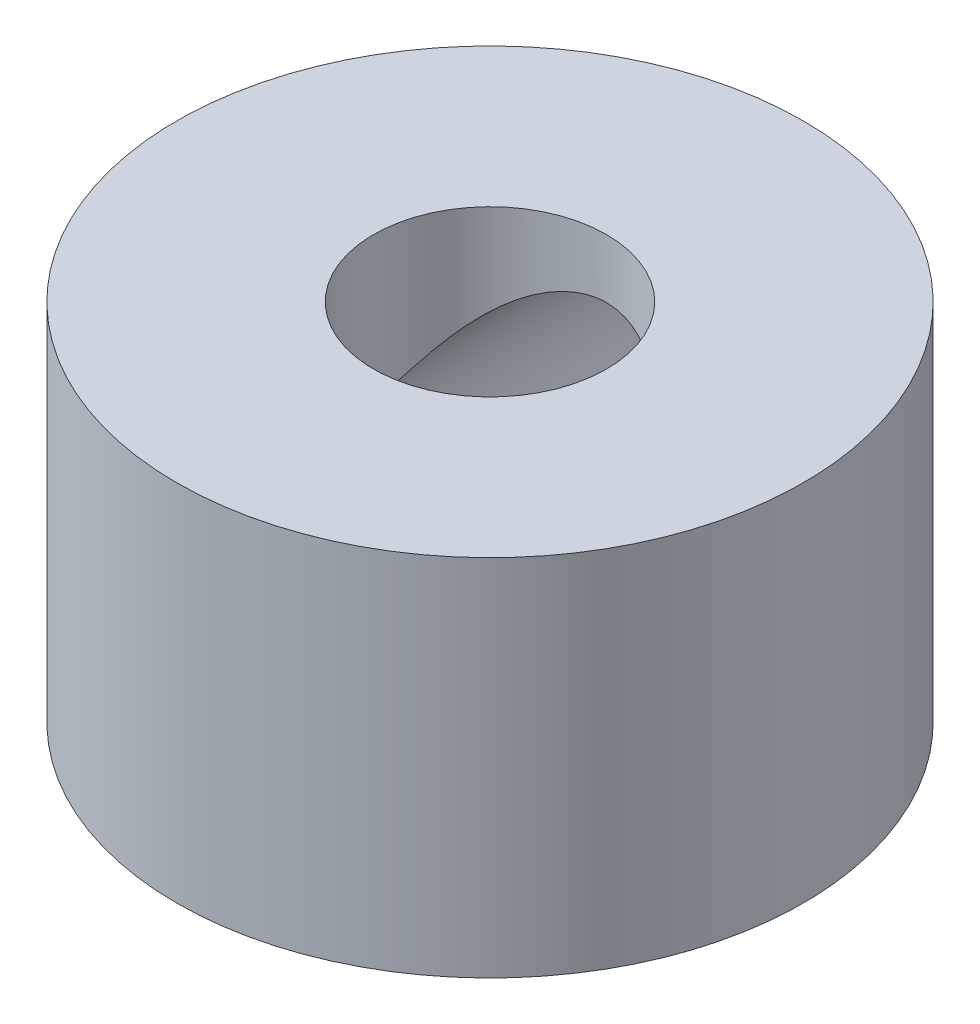
ISO-10303-21;
HEADER;
FILE_DESCRIPTION(('STEP AP214'),'2;1');
FILE_NAME('part.step','',(''),(''),'','','');
FILE_SCHEMA(('AUTOMOTIVE_DESIGN { 1 0 10303 214 1 1 1 1 }'));
ENDSEC;
DATA;
#1=APPLICATION_CONTEXT('core data for automotive mechanical design processes');
#2=APPLICATION_PROTOCOL_DEFINITION('international standard','automotive_design',2000,#1);
#3=PRODUCT_CONTEXT('',#1,'mechanical');
#4=PRODUCT('Part','Part','',(#3));
#5=PRODUCT_RELATED_PRODUCT_CATEGORY('part','',(#4));
#6=PRODUCT_DEFINITION_FORMATION('','',#4);
#7=PRODUCT_DEFINITION_CONTEXT('part definition',#1,'design');
#8=PRODUCT_DEFINITION('design','',#6,#7);
#9=PRODUCT_DEFINITION_SHAPE('','',#8);
#10=(LENGTH_UNIT() NAMED_UNIT(*) SI_UNIT(.MILLI.,.METRE.));
#11=(NAMED_UNIT(*) PLANE_ANGLE_UNIT() SI_UNIT($,.RADIAN.));
#12=(NAMED_UNIT(*) SI_UNIT($,.STERADIAN.) SOLID_ANGLE_UNIT());
#13=UNCERTAINTY_MEASURE_WITH_UNIT(LENGTH_MEASURE(1.E-05),#10,'distance_accuracy_value','');
#14=(GEOMETRIC_REPRESENTATION_CONTEXT(3) GLOBAL_UNCERTAINTY_ASSIGNED_CONTEXT((#13)) GLOBAL_UNIT_ASSIGNED_CONTEXT((#10,
#11,#12)) REPRESENTATION_CONTEXT('',''));
#15=CARTESIAN_POINT('',(0.,0.,0.));
#16=DIRECTION('',(0.,0.,1.));
#17=DIRECTION('',(1.,0.,0.));
#18=AXIS2_PLACEMENT_3D('',#15,#16,#17);
#19=CARTESIAN_POINT('',(0.,3.19405,0.));
#20=DIRECTION('',(0.,0.,1.));
#21=DIRECTION('',(1.,0.,0.));
#22=AXIS2_PLACEMENT_3D('',#19,#20,#21);
#23=PLANE('',#22);
#24=DIRECTION('',(0.,-1.,0.));
#25=VECTOR('',#24,1.);
#26=CARTESIAN_POINT('',(-2.0447,6.3881,0.));
#27=LINE('',#26,#25);
#28=CARTESIAN_POINT('',(-2.0447,3.88721874568895,0.));
#29=VERTEX_POINT('',#28);
#30=CARTESIAN_POINT('',(-2.0447,2.50088125431104,0.));
#31=VERTEX_POINT('',#30);
#32=EDGE_CURVE('E60',#29,#31,#27,.T.);
#33=ORIENTED_EDGE('',*,*,#32,.T.);
#34=CARTESIAN_POINT('',(0.,3.19405,0.));
#35=DIRECTION('',(0.,0.,1.));
#36=DIRECTION('',(1.,0.,0.));
#37=AXIS2_PLACEMENT_3D('',#34,#35,#36);
#38=CIRCLE('',#37,2.159);
#39=EDGE_CURVE('E43',#31,#29,#38,.F.);
#40=ORIENTED_EDGE('',*,*,#39,.T.);
#41=EDGE_LOOP('',(#33,#40));
#42=FACE_BOUND('',#41,.T.);
#43=ADVANCED_FACE('F17',(#42),#23,.F.);
#44=CARTESIAN_POINT('',(0.,6.3881,0.));
#45=DIRECTION('',(0.,-1.,0.));
#46=DIRECTION('',(0.,0.,-1.));
#47=AXIS2_PLACEMENT_3D('',#44,#45,#46);
#48=CYLINDRICAL_SURFACE('',#47,2.0447);
#49=DIRECTION('',(0.,1.,0.));
#50=VECTOR('',#49,1.);
#51=CARTESIAN_POINT('',(2.0447,3.19405,0.));
#52=LINE('',#51,#50);
#53=CARTESIAN_POINT('',(2.0447,3.88721874568895,0.));
#54=VERTEX_POINT('',#53);
#55=CARTESIAN_POINT('',(2.0447,2.50088125431104,0.));
#56=VERTEX_POINT('',#55);
#57=EDGE_CURVE('E55',#54,#56,#52,.F.);
#58=ORIENTED_EDGE('',*,*,#57,.T.);
#59=CARTESIAN_POINT('',(2.0447,2.50088125431104,0.));
#60=CARTESIAN_POINT('',(2.04470617199786,2.50091754640206,-0.0260635474018102));
#61=CARTESIAN_POINT('',(2.04420172874444,2.49941111831766,-0.0520883043571842));
#62=CARTESIAN_POINT('',(2.04223034606037,2.49362729040617,-0.103685006571274));
#63=CARTESIAN_POINT('',(2.04076747283227,2.48936159790736,-0.129258398146651));
#64=CARTESIAN_POINT('',(2.03510834088345,2.47312064172248,-0.203932029545053));
#65=CARTESIAN_POINT('',(2.02963586743582,2.45767309404115,-0.252180409460516));
#66=CARTESIAN_POINT('',(2.01722671913072,2.42442426490881,-0.336191631267497));
#67=CARTESIAN_POINT('',(2.01080886185513,2.40772817498889,-0.372508301241373));
#68=CARTESIAN_POINT('',(1.99635103823395,2.37170979115091,-0.443495307036483));
#69=CARTESIAN_POINT('',(1.98831003649392,2.35238582350538,-0.478164574461371));
#70=CARTESIAN_POINT('',(1.96171976878988,2.29132954390556,-0.580975144021699));
#71=CARTESIAN_POINT('',(1.94085831666927,2.24696173907065,-0.646933563168779));
#72=CARTESIAN_POINT('',(1.8927615645623,2.15405828562069,-0.776637434662795));
#73=CARTESIAN_POINT('',(1.86534900453808,2.10543614991278,-0.840251247787284));
#74=CARTESIAN_POINT('',(1.80453249240513,2.00734105909746,-0.963955545848678));
#75=CARTESIAN_POINT('',(1.77112366599197,1.95786744163219,-1.0240431112077));
#76=CARTESIAN_POINT('',(1.69837966313964,1.85969357042641,-1.140613706982));
#77=CARTESIAN_POINT('',(1.65907260612555,1.8109907983822,-1.19711212082169));
#78=CARTESIAN_POINT('',(1.57426609958005,1.71517894152762,-1.30662771770483));
#79=CARTESIAN_POINT('',(1.52877049940659,1.66806888858954,-1.35964703464135));
#80=CARTESIAN_POINT('',(1.40944344348407,1.55571001557766,-1.48483923502472));
#81=CARTESIAN_POINT('',(1.33206281265279,1.49181753722746,-1.55491953732738));
#82=CARTESIAN_POINT('',(1.16339507629861,1.37239058452521,-1.68481538216945));
#83=CARTESIAN_POINT('',(1.07212203836397,1.31684776705557,-1.74464117967459));
#84=CARTESIAN_POINT('',(0.896665121293488,1.22813781281328,-1.83971565793369));
#85=CARTESIAN_POINT('',(0.814998928352635,1.19272066947559,-1.87748752408964));
#86=CARTESIAN_POINT('',(0.644284870586461,1.13143852353685,-1.94268043620764));
#87=CARTESIAN_POINT('',(0.555247603064895,1.1055600895702,-1.97011603777885));
#88=CARTESIAN_POINT('',(0.388739139234518,1.06895357362168,-2.00887631379975));
#89=CARTESIAN_POINT('',(0.312162040957052,1.0563119009579,-2.02223874761811));
#90=CARTESIAN_POINT('',(0.157064375229523,1.03935865047825,-2.04015204240416));
#91=CARTESIAN_POINT('',(0.0785440065269985,1.0350462243273,-2.04470380074066));
#92=CARTESIAN_POINT('',(-0.0931045820543901,1.03505447561111,-2.0446954946738));
#93=CARTESIAN_POINT('',(-0.18624237828699,1.04112376893482,-2.0382898439631));
#94=CARTESIAN_POINT('',(-0.369336773949531,1.06486742271077,-2.01319435377752));
#95=CARTESIAN_POINT('',(-0.459290574564305,1.08255173856206,-1.99449397630569));
#96=CARTESIAN_POINT('',(-0.632877106470563,1.12795397997397,-1.94636409568439));
#97=CARTESIAN_POINT('',(-0.716546565044372,1.15560705151574,-1.91700393357411));
#98=CARTESIAN_POINT('',(-0.87670196273367,1.21917971146197,-1.84926099303423));
#99=CARTESIAN_POINT('',(-0.953185944029861,1.2551015437013,-1.81087576547606));
#100=CARTESIAN_POINT('',(-1.12784451221266,1.34940754729615,-1.70958867613578));
#101=CARTESIAN_POINT('',(-1.2221879693436,1.41098519265358,-1.64306531382934));
#102=CARTESIAN_POINT('',(-1.39526197071782,1.54286379264467,-1.49893221984492));
#103=CARTESIAN_POINT('',(-1.47394374123102,1.61319092320414,-1.42128911104363));
#104=CARTESIAN_POINT('',(-1.59112154059385,1.73323674310927,-1.28611202903244));
#105=CARTESIAN_POINT('',(-1.63403857707954,1.7815427823712,-1.23106373740685));
#106=CARTESIAN_POINT('',(-1.71369200019671,1.87931979148108,-1.11752995906973));
#107=CARTESIAN_POINT('',(-1.75042387105772,1.9287915826595,-1.05904200274368));
#108=CARTESIAN_POINT('',(-1.81776829683903,2.027615866108,-0.938756038911843));
#109=CARTESIAN_POINT('',(-1.84839082236244,2.07696842072586,-0.876963636885601));
#110=CARTESIAN_POINT('',(-1.90362976515796,2.17396860821924,-0.749546076866845));
#111=CARTESIAN_POINT('',(-1.92825355495983,2.22161827185108,-0.68392574771254));
#112=CARTESIAN_POINT('',(-1.96516292620499,2.29922916458566,-0.567042314984152));
#113=CARTESIAN_POINT('',(-1.97896336352726,2.33035313712099,-0.517037125226159));
#114=CARTESIAN_POINT('',(-2.0031313132669,2.38800256634513,-0.413615524622767));
#115=CARTESIAN_POINT('',(-2.01350429291604,2.41453531409985,-0.360204710158033));
#116=CARTESIAN_POINT('',(-2.02790439555594,2.45297925887348,-0.264656564482849));
#117=CARTESIAN_POINT('',(-2.03289366509492,2.46690475650676,-0.223502424938951));
#118=CARTESIAN_POINT('',(-2.04037561826575,2.48815607917188,-0.139361068900957));
#119=CARTESIAN_POINT('',(-2.04287909826282,2.49551043015333,-0.096382632392261));
#120=CARTESIAN_POINT('',(-2.04447208862978,2.50021345471073,-0.0354357391955627));
#121=CARTESIAN_POINT('',(-2.04470521262352,2.50090783247626,-0.017719357980037));
#122=CARTESIAN_POINT('',(-2.04470000000001,2.50088125430428,5.16655095470708E-13));
#123=B_SPLINE_CURVE_WITH_KNOTS('',3,(#59,#60,#61,#62,#63,#64,#65,#66,#67,#68,#69,#70,#71,#72,
#73,#74,#75,#76,#77,#78,#79,#80,#81,#82,#83,#84,#85,#86,#87,#88,#89,#90,#91,#92,#93,#94,#95,#96,
#97,#98,#99,#100,#101,#102,#103,#104,#105,#106,#107,#108,#109,#110,#111,#112,#113,#114,#115,
#116,#117,#118,#119,#120,#121,#122),.UNSPECIFIED.,.F.,.F.,(4,2,2,2,2,2,2,2,2,2,2,2,2,2,2,2,2,2,
2,2,2,2,2,2,2,2,2,2,2,2,2,4),(0.,0.0780775969975376,0.155826071151518,0.307813366091773,
0.429109563801369,0.550483381560565,0.796482314264449,1.05009359182283,1.30391196891928,
1.5565566224356,1.80904484008976,2.17493384282535,2.54045477780561,2.82943582831685,
3.11800839868693,3.35337747732871,3.58872258232785,3.86769622536399,4.1469092932171,
4.42433772242534,4.70184152435199,5.09221895881834,5.48379371669307,5.73817335827079,
5.9927379238711,6.24688357264647,6.50071527902254,6.68198836949557,6.86297089445767,
6.99374440007659,7.12394740830218,7.17709243806165),.UNSPECIFIED.);
#124=EDGE_CURVE('E47',#56,#31,#123,.T.);
#125=ORIENTED_EDGE('',*,*,#124,.T.);
#126=ORIENTED_EDGE('',*,*,#32,.F.);
#127=CARTESIAN_POINT('',(-2.0447,3.88721874568895,0.));
#128=CARTESIAN_POINT('',(-2.04470617199786,3.88718245359794,-0.02606354740181));
#129=CARTESIAN_POINT('',(-2.04420172874444,3.88868888168234,-0.052088304357184));
#130=CARTESIAN_POINT('',(-2.04223034606037,3.89447270959383,-0.103685006571274));
#131=CARTESIAN_POINT('',(-2.04076747283227,3.89873840209264,-0.129258398146651));
#132=CARTESIAN_POINT('',(-2.03510834088345,3.91497935827752,-0.203932029545052));
#133=CARTESIAN_POINT('',(-2.02963586743582,3.93042690595885,-0.252180409460516));
#134=CARTESIAN_POINT('',(-2.01722671913072,3.96367573509119,-0.336191631267496));
#135=CARTESIAN_POINT('',(-2.01080886185513,3.98037182501111,-0.372508301241372));
#136=CARTESIAN_POINT('',(-1.99635103823395,4.01639020884909,-0.443495307036483));
#137=CARTESIAN_POINT('',(-1.98831003649393,4.03571417649461,-0.47816457446137));
#138=CARTESIAN_POINT('',(-1.96171976878988,4.09677045609444,-0.580975144021698));
#139=CARTESIAN_POINT('',(-1.94085831666927,4.14113826092934,-0.646933563168777));
#140=CARTESIAN_POINT('',(-1.8927615645623,4.2340417143793,-0.776637434662793));
#141=CARTESIAN_POINT('',(-1.86534900453808,4.28266385008722,-0.840251247787283));
#142=CARTESIAN_POINT('',(-1.80453249240513,4.38075894090253,-0.963955545848677));
#143=CARTESIAN_POINT('',(-1.77112366599197,4.43023255836781,-1.0240431112077));
#144=CARTESIAN_POINT('',(-1.69837966313964,4.52840642957358,-1.140613706982));
#145=CARTESIAN_POINT('',(-1.65907260612555,4.5771092016178,-1.19711212082169));
#146=CARTESIAN_POINT('',(-1.57426609958006,4.67292105847238,-1.30662771770482));
#147=CARTESIAN_POINT('',(-1.52877049940659,4.72003111141045,-1.35964703464135));
#148=CARTESIAN_POINT('',(-1.40944344348408,4.83238998442234,-1.48483923502471));
#149=CARTESIAN_POINT('',(-1.33206281265279,4.89628246277254,-1.55491953732738));
#150=CARTESIAN_POINT('',(-1.16339507629861,5.01570941547479,-1.68481538216945));
#151=CARTESIAN_POINT('',(-1.07212203836397,5.07125223294443,-1.74464117967459));
#152=CARTESIAN_POINT('',(-0.896665121293491,5.15996218718671,-1.83971565793368));
#153=CARTESIAN_POINT('',(-0.814998928352638,5.1953793305244,-1.87748752408964));
#154=CARTESIAN_POINT('',(-0.644284870586463,5.25666147646315,-1.94268043620763));
#155=CARTESIAN_POINT('',(-0.555247603064898,5.28253991042979,-1.97011603777885));
#156=CARTESIAN_POINT('',(-0.38873913923452,5.31914642637832,-2.00887631379975));
#157=CARTESIAN_POINT('',(-0.312162040957053,5.3317880990421,-2.02223874761811));
#158=CARTESIAN_POINT('',(-0.157064375229524,5.34874134952175,-2.04015204240416));
#159=CARTESIAN_POINT('',(-0.0785440065269993,5.3530537756727,-2.04470380074066));
#160=CARTESIAN_POINT('',(0.0931045820543896,5.35304552438889,-2.0446954946738));
#161=CARTESIAN_POINT('',(0.186242378286989,5.34697623106518,-2.0382898439631));
#162=CARTESIAN_POINT('',(0.36933677394953,5.32323257728923,-2.01319435377752));
#163=CARTESIAN_POINT('',(0.459290574564304,5.30554826143793,-1.99449397630569));
#164=CARTESIAN_POINT('',(0.632877106470562,5.26014602002603,-1.94636409568439));
#165=CARTESIAN_POINT('',(0.71654656504437,5.23249294848426,-1.91700393357411));
#166=CARTESIAN_POINT('',(0.876701962733669,5.16892028853803,-1.84926099303423));
#167=CARTESIAN_POINT('',(0.95318594402986,5.1329984562987,-1.81087576547606));
#168=CARTESIAN_POINT('',(1.12784451221266,5.03869245270385,-1.70958867613578));
#169=CARTESIAN_POINT('',(1.2221879693436,4.97711480734642,-1.64306531382934));
#170=CARTESIAN_POINT('',(1.39526197071782,4.84523620735533,-1.49893221984492));
#171=CARTESIAN_POINT('',(1.47394374123102,4.77490907679586,-1.42128911104363));
#172=CARTESIAN_POINT('',(1.59112154059385,4.65486325689073,-1.28611202903245));
#173=CARTESIAN_POINT('',(1.63403857707953,4.6065572176288,-1.23106373740685));
#174=CARTESIAN_POINT('',(1.71369200019671,4.50878020851891,-1.11752995906973));
#175=CARTESIAN_POINT('',(1.75042387105772,4.4593084173405,-1.05904200274368));
#176=CARTESIAN_POINT('',(1.81776829683903,4.360484133892,-0.938756038911845));
#177=CARTESIAN_POINT('',(1.84839082236244,4.31113157927414,-0.876963636885604));
#178=CARTESIAN_POINT('',(1.90362976515795,4.21413139178076,-0.749546076866848));
#179=CARTESIAN_POINT('',(1.92825355495983,4.16648172814892,-0.683925747712542));
#180=CARTESIAN_POINT('',(1.96516292620499,4.08887083541434,-0.567042314984153));
#181=CARTESIAN_POINT('',(1.97896336352726,4.05774686287901,-0.517037125226159));
#182=CARTESIAN_POINT('',(2.0031313132669,4.00009743365487,-0.413615524622767));
#183=CARTESIAN_POINT('',(2.01350429291604,3.97356468590015,-0.360204710158034));
#184=CARTESIAN_POINT('',(2.02790439555594,3.93512074112652,-0.26465656448285));
#185=CARTESIAN_POINT('',(2.03289366509492,3.92119524349324,-0.223502424938951));
#186=CARTESIAN_POINT('',(2.04037561826575,3.89994392082812,-0.139361068900957));
#187=CARTESIAN_POINT('',(2.04287909826282,3.89258956984667,-0.0963826323922614));
#188=CARTESIAN_POINT('',(2.04447208862978,3.88788654528926,-0.0354357391955629));
#189=CARTESIAN_POINT('',(2.04470521262352,3.88719216752374,-0.0177193579800372));
#190=CARTESIAN_POINT('',(2.04470000000001,3.88721874569572,5.16457341918653E-13));
#191=B_SPLINE_CURVE_WITH_KNOTS('',3,(#127,#128,#129,#130,#131,#132,#133,#134,#135,#136,#137,
#138,#139,#140,#141,#142,#143,#144,#145,#146,#147,#148,#149,#150,#151,#152,#153,#154,#155,#156,
#157,#158,#159,#160,#161,#162,#163,#164,#165,#166,#167,#168,#169,#170,#171,#172,#173,#174,#175,
#176,#177,#178,#179,#180,#181,#182,#183,#184,#185,#186,#187,#188,#189,#190),.UNSPECIFIED.,.F.,
.F.,(4,2,2,2,2,2,2,2,2,2,2,2,2,2,2,2,2,2,2,2,2,2,2,2,2,2,2,2,2,2,2,4),(0.,0.0780775969975376,
0.155826071151518,0.307813366091773,0.429109563801368,0.550483381560563,0.796482314264448,
1.05009359182283,1.30391196891928,1.5565566224356,1.80904484008976,2.17493384282535,
2.5404547778056,2.82943582831685,3.11800839868693,3.35337747732871,3.58872258232785,
3.86769622536399,4.1469092932171,4.42433772242534,4.70184152435199,5.09221895881834,
5.48379371669306,5.73817335827079,5.9927379238711,6.24688357264647,6.50071527902254,
6.68198836949557,6.86297089445767,6.99374440007659,7.12394740830218,7.17709243806165),.UNSPECIFIED.);
#192=EDGE_CURVE('E35',#29,#54,#191,.T.);
#193=ORIENTED_EDGE('',*,*,#192,.T.);
#194=EDGE_LOOP('',(#58,#125,#126,#193));
#195=FACE_BOUND('',#194,.T.);
#196=CARTESIAN_POINT('',(0.,6.3881,0.));
#197=DIRECTION('',(0.,-1.,0.));
#198=DIRECTION('',(0.,0.,-1.));
#199=AXIS2_PLACEMENT_3D('',#196,#197,#198);
#200=CIRCLE('',#199,2.0447);
#201=CARTESIAN_POINT('',(0.,6.3881,-2.0447));
#202=VERTEX_POINT('',#201);
#203=EDGE_CURVE('E20',#202,#202,#200,.T.);
#204=ORIENTED_EDGE('',*,*,#203,.F.);
#205=EDGE_LOOP('',(#204));
#206=FACE_BOUND('',#205,.T.);
#207=CARTESIAN_POINT('',(0.,0.,0.));
#208=DIRECTION('',(0.,-1.,0.));
#209=DIRECTION('',(0.,0.,-1.));
#210=AXIS2_PLACEMENT_3D('',#207,#208,#209);
#211=CIRCLE('',#210,2.0447);
#212=CARTESIAN_POINT('',(0.,0.,-2.0447));
#213=VERTEX_POINT('',#212);
#214=EDGE_CURVE('E51',#213,#213,#211,.T.);
#215=ORIENTED_EDGE('',*,*,#214,.T.);
#216=EDGE_LOOP('',(#215));
#217=FACE_BOUND('',#216,.T.);
#218=ADVANCED_FACE('F58',(#195,#206,#217),#48,.F.);
#219=CARTESIAN_POINT('',(0.,3.19405,0.));
#220=DIRECTION('',(0.,0.,1.));
#221=DIRECTION('',(1.,0.,0.));
#222=AXIS2_PLACEMENT_3D('',#219,#220,#221);
#223=PLANE('',#222);
#224=CARTESIAN_POINT('',(0.,3.19405,0.));
#225=DIRECTION('',(0.,0.,1.));
#226=DIRECTION('',(1.,0.,0.));
#227=AXIS2_PLACEMENT_3D('',#224,#225,#226);
#228=CIRCLE('',#227,2.159);
#229=EDGE_CURVE('E50',#54,#56,#228,.F.);
#230=ORIENTED_EDGE('',*,*,#229,.T.);
#231=ORIENTED_EDGE('',*,*,#57,.F.);
#232=EDGE_LOOP('',(#230,#231));
#233=FACE_BOUND('',#232,.T.);
#234=ADVANCED_FACE('F54',(#233),#223,.F.);
#235=CARTESIAN_POINT('',(0.,6.3881,0.));
#236=DIRECTION('',(0.,1.,0.));
#237=DIRECTION('',(0.,0.,1.));
#238=AXIS2_PLACEMENT_3D('',#235,#236,#237);
#239=PLANE('',#238);
#240=CARTESIAN_POINT('',(0.,6.3881,0.));
#241=DIRECTION('',(0.,-1.,0.));
#242=DIRECTION('',(0.,0.,-1.));
#243=AXIS2_PLACEMENT_3D('',#240,#241,#242);
#244=CIRCLE('',#243,5.4991);
#245=CARTESIAN_POINT('',(0.,6.3881,-5.4991));
#246=VERTEX_POINT('',#245);
#247=EDGE_CURVE('E56',#246,#246,#244,.T.);
#248=ORIENTED_EDGE('',*,*,#247,.F.);
#249=EDGE_LOOP('',(#248));
#250=FACE_BOUND('',#249,.T.);
#251=ORIENTED_EDGE('',*,*,#203,.T.);
#252=EDGE_LOOP('',(#251));
#253=FACE_BOUND('',#252,.T.);
#254=ADVANCED_FACE('F108',(#250,#253),#239,.T.);
#255=CARTESIAN_POINT('',(0.,0.,0.));
#256=DIRECTION('',(0.,1.,0.));
#257=DIRECTION('',(0.,0.,1.));
#258=AXIS2_PLACEMENT_3D('',#255,#256,#257);
#259=PLANE('',#258);
#260=CARTESIAN_POINT('',(0.,0.,0.));
#261=DIRECTION('',(0.,-1.,0.));
#262=DIRECTION('',(0.,0.,-1.));
#263=AXIS2_PLACEMENT_3D('',#260,#261,#262);
#264=CIRCLE('',#263,5.4991);
#265=CARTESIAN_POINT('',(0.,0.,-5.4991));
#266=VERTEX_POINT('',#265);
#267=EDGE_CURVE('E26',#266,#266,#264,.F.);
#268=ORIENTED_EDGE('',*,*,#267,.F.);
#269=EDGE_LOOP('',(#268));
#270=FACE_BOUND('',#269,.T.);
#271=ORIENTED_EDGE('',*,*,#214,.F.);
#272=EDGE_LOOP('',(#271));
#273=FACE_BOUND('',#272,.T.);
#274=ADVANCED_FACE('F80',(#270,#273),#259,.F.);
#275=CARTESIAN_POINT('',(0.,3.19405,-5.4991));
#276=DIRECTION('',(0.,0.,1.));
#277=DIRECTION('',(1.,0.,0.));
#278=AXIS2_PLACEMENT_3D('',#275,#276,#277);
#279=CYLINDRICAL_SURFACE('',#278,2.159);
#280=CARTESIAN_POINT('',(0.,1.03505,-5.4991));
#281=CARTESIAN_POINT('',(0.11641572463288,1.03505455104501,-5.49909637062763));
#282=CARTESIAN_POINT('',(0.232880901809693,1.04450583755678,-5.49536649437851));
#283=CARTESIAN_POINT('',(0.462384410039382,1.08193601351528,-5.48083546427698));
#284=CARTESIAN_POINT('',(0.575419992627513,1.10992937268606,-5.47002878795907));
#285=CARTESIAN_POINT('',(0.794603933615483,1.1832764270644,-5.44250701810406));
#286=CARTESIAN_POINT('',(0.900768497728359,1.22858739238141,-5.42580647494911));
#287=CARTESIAN_POINT('',(1.10395111965049,1.33508804205556,-5.38814296543509));
#288=CARTESIAN_POINT('',(1.20096824207704,1.39627934788062,-5.36717956386264));
#289=CARTESIAN_POINT('',(1.38758335451272,1.53573225947582,-5.3220589234205));
#290=CARTESIAN_POINT('',(1.47670835883734,1.61459534662996,-5.29780543259331));
#291=CARTESIAN_POINT('',(1.64087182577614,1.7858939358925,-5.24928407385493));
#292=CARTESIAN_POINT('',(1.71590298239398,1.87833643331987,-5.22501620499304));
#293=CARTESIAN_POINT('',(1.85290781901483,2.0789736949203,-5.17806039530368));
#294=CARTESIAN_POINT('',(1.91418235578629,2.1876744557755,-5.15548506330881));
#295=CARTESIAN_POINT('',(2.01731619268302,2.41480428968844,-5.11601542695285));
#296=CARTESIAN_POINT('',(2.05920096259495,2.53322035879387,-5.09911367802481));
#297=CARTESIAN_POINT('',(2.1131791857383,2.74241632453557,-5.07692419232832));
#298=CARTESIAN_POINT('',(2.13031905119305,2.83171888106446,-5.0697135012786));
#299=CARTESIAN_POINT('',(2.15323040541576,3.01202089465676,-5.06002525636279));
#300=CARTESIAN_POINT('',(2.15900378386749,3.10302006711717,-5.05754691574331));
#301=CARTESIAN_POINT('',(2.15899517710482,3.31007621543165,-5.0575556868567));
#302=CARTESIAN_POINT('',(2.14960483337661,3.4261524039417,-5.06159315415374));
#303=CARTESIAN_POINT('',(2.11243886397986,3.65484554095434,-5.0772128272446));
#304=CARTESIAN_POINT('',(2.08464729697546,3.76745940137766,-5.08880157472028));
#305=CARTESIAN_POINT('',(2.01188906965942,3.98574641624682,-5.11799974270117));
#306=CARTESIAN_POINT('',(1.9669740024385,4.09143931340863,-5.13559106091417));
#307=CARTESIAN_POINT('',(1.86140929562221,4.2938099865341,-5.17478645690423));
#308=CARTESIAN_POINT('',(1.80075724041074,4.39048637537047,-5.19639115058673));
#309=CARTESIAN_POINT('',(1.66189173727204,4.57738450617041,-5.24250135832597));
#310=CARTESIAN_POINT('',(1.58295557252634,4.66704702652271,-5.26709766007823));
#311=CARTESIAN_POINT('',(1.41127463225133,4.83227612257525,-5.31567082071528));
#312=CARTESIAN_POINT('',(1.31852429122576,4.90783698918757,-5.33964742534455));
#313=CARTESIAN_POINT('',(1.11751716797218,5.04549042971083,-5.38537562104389));
#314=CARTESIAN_POINT('',(1.00880368701611,5.10695894385443,-5.40700737454103));
#315=CARTESIAN_POINT('',(0.781634068383293,5.21044846768593,-5.44447805544857));
#316=CARTESIAN_POINT('',(0.663190081462267,5.25249331023566,-5.46032407692264));
#317=CARTESIAN_POINT('',(0.453597471601554,5.30682793252736,-5.48107846463227));
#318=CARTESIAN_POINT('',(0.363894447038076,5.32411974796641,-5.48779600708384));
#319=CARTESIAN_POINT('',(0.182804309951275,5.34723187548478,-5.49680793253281));
#320=CARTESIAN_POINT('',(0.0914174022811576,5.3530535737845,-5.49910285002559));
#321=CARTESIAN_POINT('',(-0.116415724632881,5.35304544895499,-5.49909637062763));
#322=CARTESIAN_POINT('',(-0.232880901809694,5.34359416244321,-5.49536649437851));
#323=CARTESIAN_POINT('',(-0.462384410039383,5.30616398648471,-5.48083546427698));
#324=CARTESIAN_POINT('',(-0.575419992627515,5.27817062731394,-5.47002878795907));
#325=CARTESIAN_POINT('',(-0.794603933615484,5.2048235729356,-5.44250701810406));
#326=CARTESIAN_POINT('',(-0.90076849772836,5.15951260761859,-5.42580647494911));
#327=CARTESIAN_POINT('',(-1.10395111965049,5.05301195794443,-5.38814296543509));
#328=CARTESIAN_POINT('',(-1.20096824207704,4.99182065211938,-5.36717956386264));
#329=CARTESIAN_POINT('',(-1.38758335451272,4.85236774052417,-5.3220589234205));
#330=CARTESIAN_POINT('',(-1.47670835883734,4.77350465337003,-5.29780543259331));
#331=CARTESIAN_POINT('',(-1.64087182577614,4.6022060641075,-5.24928407385493));
#332=CARTESIAN_POINT('',(-1.71590298239398,4.50976356668012,-5.22501620499304));
#333=CARTESIAN_POINT('',(-1.85290781901483,4.3091263050797,-5.17806039530368));
#334=CARTESIAN_POINT('',(-1.91418235578629,4.2004255442245,-5.15548506330881));
#335=CARTESIAN_POINT('',(-2.01731619268303,3.97329571031156,-5.11601542695285));
#336=CARTESIAN_POINT('',(-2.05920096259495,3.85487964120613,-5.09911367802481));
#337=CARTESIAN_POINT('',(-2.1131791857383,3.64568367546443,-5.07692419232832));
#338=CARTESIAN_POINT('',(-2.13031905119305,3.55638111893554,-5.0697135012786));
#339=CARTESIAN_POINT('',(-2.15323040541576,3.37607910534324,-5.06002525636279));
#340=CARTESIAN_POINT('',(-2.15900378386749,3.28507993288283,-5.05754691574331));
#341=CARTESIAN_POINT('',(-2.15899517710482,3.07802378456834,-5.0575556868567));
#342=CARTESIAN_POINT('',(-2.14960483337661,2.9619475960583,-5.06159315415374));
#343=CARTESIAN_POINT('',(-2.11243886397986,2.73325445904566,-5.0772128272446));
#344=CARTESIAN_POINT('',(-2.08464729697545,2.62064059862233,-5.08880157472028));
#345=CARTESIAN_POINT('',(-2.01188906965942,2.40235358375318,-5.11799974270117));
#346=CARTESIAN_POINT('',(-1.9669740024385,2.29666068659137,-5.13559106091417));
#347=CARTESIAN_POINT('',(-1.8614092956222,2.0942900134659,-5.17478645690423));
#348=CARTESIAN_POINT('',(-1.80075724041074,1.99761362462953,-5.19639115058673));
#349=CARTESIAN_POINT('',(-1.66189173727203,1.81071549382959,-5.24250135832597));
#350=CARTESIAN_POINT('',(-1.58295557252634,1.72105297347728,-5.26709766007823));
#351=CARTESIAN_POINT('',(-1.41127463225133,1.55582387742474,-5.31567082071528));
#352=CARTESIAN_POINT('',(-1.31852429122576,1.48026301081243,-5.33964742534455));
#353=CARTESIAN_POINT('',(-1.11751716797218,1.34260957028917,-5.38537562104389));
#354=CARTESIAN_POINT('',(-1.00880368701611,1.28114105614557,-5.40700737454103));
#355=CARTESIAN_POINT('',(-0.781634068383292,1.17765153231407,-5.44447805544857));
#356=CARTESIAN_POINT('',(-0.663190081462267,1.13560668976434,-5.46032407692264));
#357=CARTESIAN_POINT('',(-0.453597471601554,1.08127206747264,-5.48107846463227));
#358=CARTESIAN_POINT('',(-0.363894447038077,1.06398025203359,-5.48779600708384));
#359=CARTESIAN_POINT('',(-0.182804309951276,1.04086812451522,-5.49680793253281));
#360=CARTESIAN_POINT('',(-0.091417402281159,1.0350464262155,-5.49910285002559));
#361=CARTESIAN_POINT('',(0.,1.03505,-5.4991));
#362=B_SPLINE_CURVE_WITH_KNOTS('',3,(#280,#281,#282,#283,#284,#285,#286,#287,#288,#289,#290,
#291,#292,#293,#294,#295,#296,#297,#298,#299,#300,#301,#302,#303,#304,#305,#306,#307,#308,#309,
#310,#311,#312,#313,#314,#315,#316,#317,#318,#319,#320,#321,#322,#323,#324,#325,#326,#327,#328,
#329,#330,#331,#332,#333,#334,#335,#336,#337,#338,#339,#340,#341,#342,#343,#344,#345,#346,#347,
#348,#349,#350,#351,#352,#353,#354,#355,#356,#357,#358,#359,#360,#361),.UNSPECIFIED.,.T.,.F.,(4,
2,2,2,2,2,2,2,2,2,2,2,2,2,2,2,2,2,2,2,2,2,2,2,2,2,2,2,2,2,2,2,2,2,2,2,2,2,2,2,4),(0.,
0.34890029537142,0.698073184229714,1.0463900200591,1.39474243490726,1.75750649615054,
2.12045809188481,2.49899686648853,2.87703698363112,3.14989761190831,3.42271287314727,
3.77044159567964,4.1184719571771,4.46546188646533,4.81250510999578,5.17678830698723,
5.54121866646947,5.91955718655224,6.29743024384803,6.57144317635494,6.84542299101114,
7.19432328638256,7.54349617524085,7.89181301107024,8.2401654259184,8.60292948716168,
8.96588108289595,9.34441985749967,9.72245997464226,9.99532060291945,10.2681358641584,
10.6158645866908,10.9638949481882,11.3108848774765,11.6579281010069,12.0222112979984,
12.3866416574806,12.7649801775634,13.1428532348592,13.4168661673661,13.6908459820223),.UNSPECIFIED.);
#363=CARTESIAN_POINT('',(0.,1.03505,-5.4991));
#364=VERTEX_POINT('',#363);
#365=EDGE_CURVE('E11',#364,#364,#362,.T.);
#366=ORIENTED_EDGE('',*,*,#365,.F.);
#367=EDGE_LOOP('',(#366));
#368=FACE_BOUND('',#367,.T.);
#369=ORIENTED_EDGE('',*,*,#124,.F.);
#370=ORIENTED_EDGE('',*,*,#229,.F.);
#371=ORIENTED_EDGE('',*,*,#192,.F.);
#372=ORIENTED_EDGE('',*,*,#39,.F.);
#373=EDGE_LOOP('',(#369,#370,#371,#372));
#374=FACE_BOUND('',#373,.T.);
#375=ADVANCED_FACE('F49',(#368,#374),#279,.F.);
#376=CARTESIAN_POINT('',(0.,6.3881,0.));
#377=DIRECTION('',(0.,-1.,0.));
#378=DIRECTION('',(0.,0.,-1.));
#379=AXIS2_PLACEMENT_3D('',#376,#377,#378);
#380=CYLINDRICAL_SURFACE('',#379,5.4991);
#381=ORIENTED_EDGE('',*,*,#365,.T.);
#382=EDGE_LOOP('',(#381));
#383=FACE_BOUND('',#382,.T.);
#384=ORIENTED_EDGE('',*,*,#267,.T.);
#385=EDGE_LOOP('',(#384));
#386=FACE_BOUND('',#385,.T.);
#387=ORIENTED_EDGE('',*,*,#247,.T.);
#388=EDGE_LOOP('',(#387));
#389=FACE_BOUND('',#388,.T.);
#390=ADVANCED_FACE('F72',(#383,#386,#389),#380,.T.);
#391=CLOSED_SHELL('',(#43,#218,#234,#254,#274,#375,#390));
#392=MANIFOLD_SOLID_BREP('B1',#391);
#393=ADVANCED_BREP_SHAPE_REPRESENTATION('',(#18,#392),#14);
#394=SHAPE_DEFINITION_REPRESENTATION(#9,#393);
ENDSEC;
END-ISO-10303-21;
